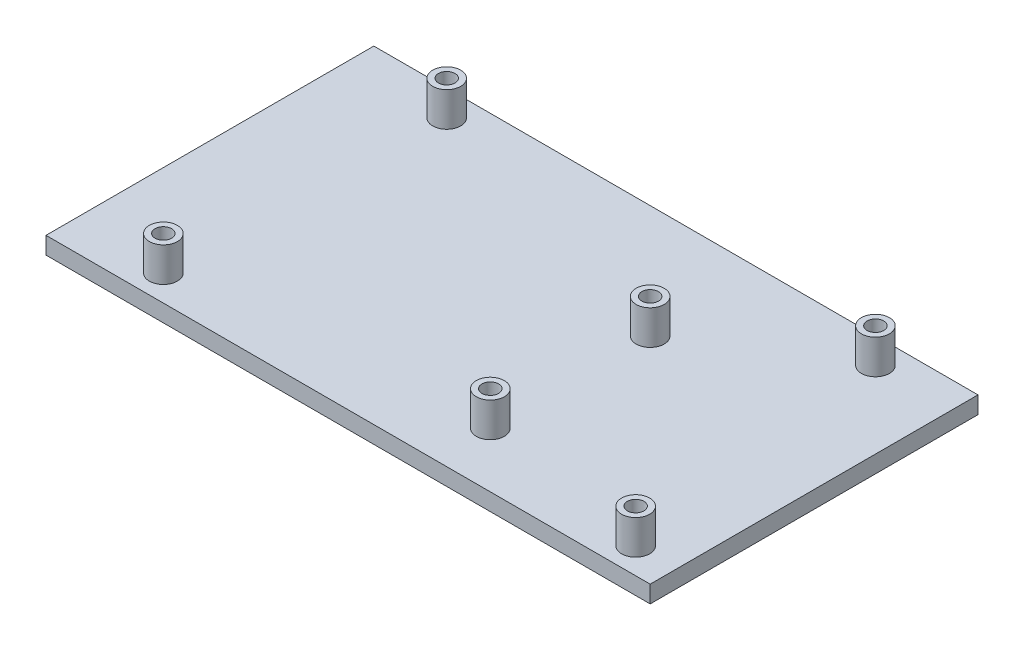
ISO-10303-21;
HEADER;
FILE_DESCRIPTION(('STEP AP214'),'2;1');
FILE_NAME('part.step','',(''),(''),'','','');
FILE_SCHEMA(('AUTOMOTIVE_DESIGN { 1 0 10303 214 1 1 1 1 }'));
ENDSEC;
DATA;
#1=APPLICATION_CONTEXT('core data for automotive mechanical design processes');
#2=APPLICATION_PROTOCOL_DEFINITION('international standard','automotive_design',2000,#1);
#3=PRODUCT_CONTEXT('',#1,'mechanical');
#4=PRODUCT('Part','Part','',(#3));
#5=PRODUCT_RELATED_PRODUCT_CATEGORY('part','',(#4));
#6=PRODUCT_DEFINITION_FORMATION('','',#4);
#7=PRODUCT_DEFINITION_CONTEXT('part definition',#1,'design');
#8=PRODUCT_DEFINITION('design','',#6,#7);
#9=PRODUCT_DEFINITION_SHAPE('','',#8);
#10=(LENGTH_UNIT() NAMED_UNIT(*) SI_UNIT(.MILLI.,.METRE.));
#11=(NAMED_UNIT(*) PLANE_ANGLE_UNIT() SI_UNIT($,.RADIAN.));
#12=(NAMED_UNIT(*) SI_UNIT($,.STERADIAN.) SOLID_ANGLE_UNIT());
#13=UNCERTAINTY_MEASURE_WITH_UNIT(LENGTH_MEASURE(1.E-05),#10,'distance_accuracy_value','');
#14=(GEOMETRIC_REPRESENTATION_CONTEXT(3) GLOBAL_UNCERTAINTY_ASSIGNED_CONTEXT((#13)) GLOBAL_UNIT_ASSIGNED_CONTEXT((#10,
#11,#12)) REPRESENTATION_CONTEXT('',''));
#15=CARTESIAN_POINT('',(0.,0.,0.));
#16=DIRECTION('',(0.,0.,1.));
#17=DIRECTION('',(1.,0.,0.));
#18=AXIS2_PLACEMENT_3D('',#15,#16,#17);
#19=CARTESIAN_POINT('',(-2.,-3.,0.));
#20=DIRECTION('',(1.,0.,0.));
#21=DIRECTION('',(0.,0.,-1.));
#22=AXIS2_PLACEMENT_3D('',#19,#20,#21);
#23=PLANE('',#22);
#24=DIRECTION('',(0.,0.,-1.));
#25=VECTOR('',#24,1.);
#26=CARTESIAN_POINT('',(-2.,0.,0.));
#27=LINE('',#26,#25);
#28=CARTESIAN_POINT('',(-2.,0.,2.));
#29=VERTEX_POINT('',#28);
#30=CARTESIAN_POINT('',(-2.,0.,-55.3));
#31=VERTEX_POINT('',#30);
#32=EDGE_CURVE('E120',#29,#31,#27,.T.);
#33=ORIENTED_EDGE('',*,*,#32,.T.);
#34=DIRECTION('',(0.,1.,0.));
#35=VECTOR('',#34,1.);
#36=CARTESIAN_POINT('',(-2.,-3.,-55.3));
#37=LINE('',#36,#35);
#38=CARTESIAN_POINT('',(-2.,-3.,-55.3));
#39=VERTEX_POINT('',#38);
#40=EDGE_CURVE('E132',#39,#31,#37,.T.);
#41=ORIENTED_EDGE('',*,*,#40,.F.);
#42=DIRECTION('',(0.,0.,-1.));
#43=VECTOR('',#42,1.);
#44=CARTESIAN_POINT('',(-2.,-3.,0.));
#45=LINE('',#44,#43);
#46=CARTESIAN_POINT('',(-2.,-3.,2.));
#47=VERTEX_POINT('',#46);
#48=EDGE_CURVE('E112',#47,#39,#45,.T.);
#49=ORIENTED_EDGE('',*,*,#48,.F.);
#50=DIRECTION('',(0.,1.,0.));
#51=VECTOR('',#50,1.);
#52=CARTESIAN_POINT('',(-2.,-3.,2.));
#53=LINE('',#52,#51);
#54=EDGE_CURVE('E93',#47,#29,#53,.T.);
#55=ORIENTED_EDGE('',*,*,#54,.T.);
#56=EDGE_LOOP('',(#33,#41,#49,#55));
#57=FACE_BOUND('',#56,.T.);
#58=ADVANCED_FACE('F47',(#57),#23,.F.);
#59=CARTESIAN_POINT('',(0.,-3.,-55.3));
#60=DIRECTION('',(0.,0.,1.));
#61=DIRECTION('',(1.,0.,0.));
#62=AXIS2_PLACEMENT_3D('',#59,#60,#61);
#63=PLANE('',#62);
#64=DIRECTION('',(1.,0.,0.));
#65=VECTOR('',#64,1.);
#66=CARTESIAN_POINT('',(0.,0.,-55.3));
#67=LINE('',#66,#65);
#68=CARTESIAN_POINT('',(103.6,0.,-55.3));
#69=VERTEX_POINT('',#68);
#70=EDGE_CURVE('E87',#31,#69,#67,.T.);
#71=ORIENTED_EDGE('',*,*,#70,.T.);
#72=DIRECTION('',(0.,1.,0.));
#73=VECTOR('',#72,1.);
#74=CARTESIAN_POINT('',(103.6,-3.,-55.3));
#75=LINE('',#74,#73);
#76=CARTESIAN_POINT('',(103.6,-3.,-55.3));
#77=VERTEX_POINT('',#76);
#78=EDGE_CURVE('E80',#77,#69,#75,.T.);
#79=ORIENTED_EDGE('',*,*,#78,.F.);
#80=DIRECTION('',(1.,0.,0.));
#81=VECTOR('',#80,1.);
#82=CARTESIAN_POINT('',(0.,-3.,-55.3));
#83=LINE('',#82,#81);
#84=EDGE_CURVE('E64',#39,#77,#83,.T.);
#85=ORIENTED_EDGE('',*,*,#84,.F.);
#86=ORIENTED_EDGE('',*,*,#40,.T.);
#87=EDGE_LOOP('',(#71,#79,#85,#86));
#88=FACE_BOUND('',#87,.T.);
#89=ADVANCED_FACE('F188',(#88),#63,.F.);
#90=CARTESIAN_POINT('',(103.6,-3.,0.));
#91=DIRECTION('',(1.,0.,0.));
#92=DIRECTION('',(0.,0.,-1.));
#93=AXIS2_PLACEMENT_3D('',#90,#91,#92);
#94=PLANE('',#93);
#95=DIRECTION('',(0.,0.,-1.));
#96=VECTOR('',#95,1.);
#97=CARTESIAN_POINT('',(103.6,0.,0.));
#98=LINE('',#97,#96);
#99=CARTESIAN_POINT('',(103.6,0.,2.));
#100=VERTEX_POINT('',#99);
#101=EDGE_CURVE('E100',#100,#69,#98,.T.);
#102=ORIENTED_EDGE('',*,*,#101,.F.);
#103=DIRECTION('',(0.,1.,0.));
#104=VECTOR('',#103,1.);
#105=CARTESIAN_POINT('',(103.6,-3.,2.));
#106=LINE('',#105,#104);
#107=CARTESIAN_POINT('',(103.6,-3.,2.));
#108=VERTEX_POINT('',#107);
#109=EDGE_CURVE('E96',#108,#100,#106,.T.);
#110=ORIENTED_EDGE('',*,*,#109,.F.);
#111=DIRECTION('',(0.,0.,-1.));
#112=VECTOR('',#111,1.);
#113=CARTESIAN_POINT('',(103.6,-3.,0.));
#114=LINE('',#113,#112);
#115=EDGE_CURVE('E99',#108,#77,#114,.T.);
#116=ORIENTED_EDGE('',*,*,#115,.T.);
#117=ORIENTED_EDGE('',*,*,#78,.T.);
#118=EDGE_LOOP('',(#102,#110,#116,#117));
#119=FACE_BOUND('',#118,.T.);
#120=ADVANCED_FACE('F98',(#119),#94,.T.);
#121=CARTESIAN_POINT('',(0.,-3.,2.));
#122=DIRECTION('',(0.,0.,1.));
#123=DIRECTION('',(1.,0.,0.));
#124=AXIS2_PLACEMENT_3D('',#121,#122,#123);
#125=PLANE('',#124);
#126=DIRECTION('',(1.,0.,0.));
#127=VECTOR('',#126,1.);
#128=CARTESIAN_POINT('',(0.,0.,2.));
#129=LINE('',#128,#127);
#130=EDGE_CURVE('E124',#29,#100,#129,.T.);
#131=ORIENTED_EDGE('',*,*,#130,.F.);
#132=ORIENTED_EDGE('',*,*,#54,.F.);
#133=DIRECTION('',(1.,0.,0.));
#134=VECTOR('',#133,1.);
#135=CARTESIAN_POINT('',(0.,-3.,2.));
#136=LINE('',#135,#134);
#137=EDGE_CURVE('E107',#47,#108,#136,.T.);
#138=ORIENTED_EDGE('',*,*,#137,.T.);
#139=ORIENTED_EDGE('',*,*,#109,.T.);
#140=EDGE_LOOP('',(#131,#132,#138,#139));
#141=FACE_BOUND('',#140,.T.);
#142=ADVANCED_FACE('F110',(#141),#125,.T.);
#143=CARTESIAN_POINT('',(0.,-3.,0.));
#144=DIRECTION('',(0.,1.,0.));
#145=DIRECTION('',(0.,0.,1.));
#146=AXIS2_PLACEMENT_3D('',#143,#144,#145);
#147=PLANE('',#146);
#148=ORIENTED_EDGE('',*,*,#48,.T.);
#149=ORIENTED_EDGE('',*,*,#84,.T.);
#150=ORIENTED_EDGE('',*,*,#115,.F.);
#151=ORIENTED_EDGE('',*,*,#137,.F.);
#152=EDGE_LOOP('',(#148,#149,#150,#151));
#153=FACE_BOUND('',#152,.T.);
#154=ADVANCED_FACE('F106',(#153),#147,.F.);
#155=CARTESIAN_POINT('',(0.,0.,0.));
#156=DIRECTION('',(0.,1.,0.));
#157=DIRECTION('',(0.,0.,1.));
#158=AXIS2_PLACEMENT_3D('',#155,#156,#157);
#159=PLANE('',#158);
#160=CARTESIAN_POINT('',(13.97,0.,-2.54));
#161=DIRECTION('',(0.,1.,0.));
#162=DIRECTION('',(0.,0.,1.));
#163=AXIS2_PLACEMENT_3D('',#160,#161,#162);
#164=CIRCLE('',#163,2.45);
#165=CARTESIAN_POINT('',(13.97,0.,-0.0899999999999994));
#166=VERTEX_POINT('',#165);
#167=EDGE_CURVE('E333',#166,#166,#164,.T.);
#168=ORIENTED_EDGE('',*,*,#167,.F.);
#169=EDGE_LOOP('',(#168));
#170=FACE_BOUND('',#169,.T.);
#171=CARTESIAN_POINT('',(15.24,0.,-50.8));
#172=DIRECTION('',(0.,1.,0.));
#173=DIRECTION('',(0.,0.,1.));
#174=AXIS2_PLACEMENT_3D('',#171,#172,#173);
#175=CIRCLE('',#174,2.45);
#176=CARTESIAN_POINT('',(15.24,0.,-48.35));
#177=VERTEX_POINT('',#176);
#178=EDGE_CURVE('E314',#177,#177,#175,.T.);
#179=ORIENTED_EDGE('',*,*,#178,.F.);
#180=EDGE_LOOP('',(#179));
#181=FACE_BOUND('',#180,.T.);
#182=CARTESIAN_POINT('',(90.17,0.,-50.8));
#183=DIRECTION('',(0.,1.,0.));
#184=DIRECTION('',(0.,0.,1.));
#185=AXIS2_PLACEMENT_3D('',#182,#183,#184);
#186=CIRCLE('',#185,2.44999999999999);
#187=CARTESIAN_POINT('',(90.17,0.,-48.35));
#188=VERTEX_POINT('',#187);
#189=EDGE_CURVE('E302',#188,#188,#186,.T.);
#190=ORIENTED_EDGE('',*,*,#189,.F.);
#191=EDGE_LOOP('',(#190));
#192=FACE_BOUND('',#191,.T.);
#193=CARTESIAN_POINT('',(66.04,0.,-35.56));
#194=DIRECTION('',(0.,1.,0.));
#195=DIRECTION('',(0.,0.,1.));
#196=AXIS2_PLACEMENT_3D('',#193,#194,#195);
#197=CIRCLE('',#196,2.44999999999999);
#198=CARTESIAN_POINT('',(66.04,0.,-33.11));
#199=VERTEX_POINT('',#198);
#200=EDGE_CURVE('E292',#199,#199,#197,.T.);
#201=ORIENTED_EDGE('',*,*,#200,.F.);
#202=EDGE_LOOP('',(#201));
#203=FACE_BOUND('',#202,.T.);
#204=CARTESIAN_POINT('',(96.52,0.,-2.54));
#205=DIRECTION('',(0.,1.,0.));
#206=DIRECTION('',(0.,0.,1.));
#207=AXIS2_PLACEMENT_3D('',#204,#205,#206);
#208=CIRCLE('',#207,2.45000000000001);
#209=CARTESIAN_POINT('',(96.52,0.,-0.0899999999999924));
#210=VERTEX_POINT('',#209);
#211=EDGE_CURVE('E275',#210,#210,#208,.T.);
#212=ORIENTED_EDGE('',*,*,#211,.F.);
#213=EDGE_LOOP('',(#212));
#214=FACE_BOUND('',#213,.T.);
#215=CARTESIAN_POINT('',(66.04,0.,-7.62));
#216=DIRECTION('',(0.,1.,0.));
#217=DIRECTION('',(0.,0.,1.));
#218=AXIS2_PLACEMENT_3D('',#215,#216,#217);
#219=CIRCLE('',#218,2.44999999999999);
#220=CARTESIAN_POINT('',(66.04,0.,-5.17000000000001));
#221=VERTEX_POINT('',#220);
#222=EDGE_CURVE('E271',#221,#221,#219,.T.);
#223=ORIENTED_EDGE('',*,*,#222,.F.);
#224=EDGE_LOOP('',(#223));
#225=FACE_BOUND('',#224,.T.);
#226=ORIENTED_EDGE('',*,*,#32,.F.);
#227=ORIENTED_EDGE('',*,*,#130,.T.);
#228=ORIENTED_EDGE('',*,*,#101,.T.);
#229=ORIENTED_EDGE('',*,*,#70,.F.);
#230=EDGE_LOOP('',(#226,#227,#228,#229));
#231=FACE_BOUND('',#230,.T.);
#232=ADVANCED_FACE('F177',(#170,#181,#192,#203,#214,#225,#231),#159,.T.);
#233=CARTESIAN_POINT('',(66.04,6.,-7.62));
#234=DIRECTION('',(0.,-1.,0.));
#235=DIRECTION('',(0.,0.,-1.));
#236=AXIS2_PLACEMENT_3D('',#233,#234,#235);
#237=CYLINDRICAL_SURFACE('',#236,1.45);
#238=CARTESIAN_POINT('',(66.04,6.,-7.62));
#239=DIRECTION('',(0.,1.,0.));
#240=DIRECTION('',(0.,0.,1.));
#241=AXIS2_PLACEMENT_3D('',#238,#239,#240);
#242=CIRCLE('',#241,1.45);
#243=CARTESIAN_POINT('',(66.04,6.,-6.17));
#244=VERTEX_POINT('',#243);
#245=EDGE_CURVE('E274',#244,#244,#242,.T.);
#246=ORIENTED_EDGE('',*,*,#245,.T.);
#247=EDGE_LOOP('',(#246));
#248=FACE_BOUND('',#247,.T.);
#249=CARTESIAN_POINT('',(66.04,0.,-7.62));
#250=DIRECTION('',(0.,1.,0.));
#251=DIRECTION('',(0.,0.,1.));
#252=AXIS2_PLACEMENT_3D('',#249,#250,#251);
#253=CIRCLE('',#252,1.45);
#254=CARTESIAN_POINT('',(66.04,0.,-6.17));
#255=VERTEX_POINT('',#254);
#256=EDGE_CURVE('E135',#255,#255,#253,.F.);
#257=ORIENTED_EDGE('',*,*,#256,.T.);
#258=EDGE_LOOP('',(#257));
#259=FACE_BOUND('',#258,.T.);
#260=ADVANCED_FACE('F195',(#248,#259),#237,.F.);
#261=CARTESIAN_POINT('',(66.04,6.,-7.62));
#262=DIRECTION('',(0.,-1.,0.));
#263=DIRECTION('',(0.,0.,-1.));
#264=AXIS2_PLACEMENT_3D('',#261,#262,#263);
#265=CYLINDRICAL_SURFACE('',#264,2.44999999999999);
#266=CARTESIAN_POINT('',(66.04,6.,-7.62));
#267=DIRECTION('',(0.,1.,0.));
#268=DIRECTION('',(0.,0.,1.));
#269=AXIS2_PLACEMENT_3D('',#266,#267,#268);
#270=CIRCLE('',#269,2.44999999999999);
#271=CARTESIAN_POINT('',(66.04,6.,-5.17000000000001));
#272=VERTEX_POINT('',#271);
#273=EDGE_CURVE('E125',#272,#272,#270,.T.);
#274=ORIENTED_EDGE('',*,*,#273,.F.);
#275=EDGE_LOOP('',(#274));
#276=FACE_BOUND('',#275,.T.);
#277=ORIENTED_EDGE('',*,*,#222,.T.);
#278=EDGE_LOOP('',(#277));
#279=FACE_BOUND('',#278,.T.);
#280=ADVANCED_FACE('F202',(#276,#279),#265,.T.);
#281=CARTESIAN_POINT('',(0.,6.,0.));
#282=DIRECTION('',(0.,1.,0.));
#283=DIRECTION('',(0.,0.,1.));
#284=AXIS2_PLACEMENT_3D('',#281,#282,#283);
#285=PLANE('',#284);
#286=ORIENTED_EDGE('',*,*,#245,.F.);
#287=EDGE_LOOP('',(#286));
#288=FACE_BOUND('',#287,.T.);
#289=ORIENTED_EDGE('',*,*,#273,.T.);
#290=EDGE_LOOP('',(#289));
#291=FACE_BOUND('',#290,.T.);
#292=ADVANCED_FACE('F209',(#288,#291),#285,.T.);
#293=ORIENTED_EDGE('',*,*,#256,.F.);
#294=EDGE_LOOP('',(#293));
#295=FACE_BOUND('',#294,.T.);
#296=ADVANCED_FACE('F197',(#295),#159,.T.);
#297=CARTESIAN_POINT('',(96.52,6.,-2.54));
#298=DIRECTION('',(0.,-1.,0.));
#299=DIRECTION('',(0.,0.,-1.));
#300=AXIS2_PLACEMENT_3D('',#297,#298,#299);
#301=CYLINDRICAL_SURFACE('',#300,1.45);
#302=CARTESIAN_POINT('',(96.52,6.,-2.54));
#303=DIRECTION('',(0.,1.,0.));
#304=DIRECTION('',(0.,0.,1.));
#305=AXIS2_PLACEMENT_3D('',#302,#303,#304);
#306=CIRCLE('',#305,1.45);
#307=CARTESIAN_POINT('',(96.52,6.,-1.09));
#308=VERTEX_POINT('',#307);
#309=EDGE_CURVE('E281',#308,#308,#306,.T.);
#310=ORIENTED_EDGE('',*,*,#309,.T.);
#311=EDGE_LOOP('',(#310));
#312=FACE_BOUND('',#311,.T.);
#313=CARTESIAN_POINT('',(96.52,0.,-2.54));
#314=DIRECTION('',(0.,1.,0.));
#315=DIRECTION('',(0.,0.,1.));
#316=AXIS2_PLACEMENT_3D('',#313,#314,#315);
#317=CIRCLE('',#316,1.45);
#318=CARTESIAN_POINT('',(96.52,0.,-1.09));
#319=VERTEX_POINT('',#318);
#320=EDGE_CURVE('E143',#319,#319,#317,.F.);
#321=ORIENTED_EDGE('',*,*,#320,.T.);
#322=EDGE_LOOP('',(#321));
#323=FACE_BOUND('',#322,.T.);
#324=ADVANCED_FACE('F208',(#312,#323),#301,.F.);
#325=CARTESIAN_POINT('',(96.52,6.,-2.54));
#326=DIRECTION('',(0.,-1.,0.));
#327=DIRECTION('',(0.,0.,-1.));
#328=AXIS2_PLACEMENT_3D('',#325,#326,#327);
#329=CYLINDRICAL_SURFACE('',#328,2.45000000000001);
#330=CARTESIAN_POINT('',(96.52,6.,-2.54));
#331=DIRECTION('',(0.,1.,0.));
#332=DIRECTION('',(0.,0.,1.));
#333=AXIS2_PLACEMENT_3D('',#330,#331,#332);
#334=CIRCLE('',#333,2.45000000000001);
#335=CARTESIAN_POINT('',(96.52,6.,-0.0899999999999924));
#336=VERTEX_POINT('',#335);
#337=EDGE_CURVE('E289',#336,#336,#334,.T.);
#338=ORIENTED_EDGE('',*,*,#337,.F.);
#339=EDGE_LOOP('',(#338));
#340=FACE_BOUND('',#339,.T.);
#341=ORIENTED_EDGE('',*,*,#211,.T.);
#342=EDGE_LOOP('',(#341));
#343=FACE_BOUND('',#342,.T.);
#344=ADVANCED_FACE('F216',(#340,#343),#329,.T.);
#345=CARTESIAN_POINT('',(0.,6.,0.));
#346=DIRECTION('',(0.,1.,0.));
#347=DIRECTION('',(0.,0.,1.));
#348=AXIS2_PLACEMENT_3D('',#345,#346,#347);
#349=PLANE('',#348);
#350=ORIENTED_EDGE('',*,*,#309,.F.);
#351=EDGE_LOOP('',(#350));
#352=FACE_BOUND('',#351,.T.);
#353=ORIENTED_EDGE('',*,*,#337,.T.);
#354=EDGE_LOOP('',(#353));
#355=FACE_BOUND('',#354,.T.);
#356=ADVANCED_FACE('F224',(#352,#355),#349,.T.);
#357=ORIENTED_EDGE('',*,*,#320,.F.);
#358=EDGE_LOOP('',(#357));
#359=FACE_BOUND('',#358,.T.);
#360=ADVANCED_FACE('F211',(#359),#159,.T.);
#361=CARTESIAN_POINT('',(66.04,6.,-35.56));
#362=DIRECTION('',(0.,-1.,0.));
#363=DIRECTION('',(0.,0.,-1.));
#364=AXIS2_PLACEMENT_3D('',#361,#362,#363);
#365=CYLINDRICAL_SURFACE('',#364,1.45);
#366=CARTESIAN_POINT('',(66.04,6.,-35.56));
#367=DIRECTION('',(0.,1.,0.));
#368=DIRECTION('',(0.,0.,1.));
#369=AXIS2_PLACEMENT_3D('',#366,#367,#368);
#370=CIRCLE('',#369,1.45);
#371=CARTESIAN_POINT('',(66.04,6.,-34.11));
#372=VERTEX_POINT('',#371);
#373=EDGE_CURVE('E294',#372,#372,#370,.T.);
#374=ORIENTED_EDGE('',*,*,#373,.T.);
#375=EDGE_LOOP('',(#374));
#376=FACE_BOUND('',#375,.T.);
#377=CARTESIAN_POINT('',(66.04,0.,-35.56));
#378=DIRECTION('',(0.,1.,0.));
#379=DIRECTION('',(0.,0.,1.));
#380=AXIS2_PLACEMENT_3D('',#377,#378,#379);
#381=CIRCLE('',#380,1.45);
#382=CARTESIAN_POINT('',(66.04,0.,-34.11));
#383=VERTEX_POINT('',#382);
#384=EDGE_CURVE('E147',#383,#383,#381,.F.);
#385=ORIENTED_EDGE('',*,*,#384,.T.);
#386=EDGE_LOOP('',(#385));
#387=FACE_BOUND('',#386,.T.);
#388=ADVANCED_FACE('F223',(#376,#387),#365,.F.);
#389=CARTESIAN_POINT('',(66.04,6.,-35.56));
#390=DIRECTION('',(0.,-1.,0.));
#391=DIRECTION('',(0.,0.,-1.));
#392=AXIS2_PLACEMENT_3D('',#389,#390,#391);
#393=CYLINDRICAL_SURFACE('',#392,2.44999999999999);
#394=CARTESIAN_POINT('',(66.04,6.,-35.56));
#395=DIRECTION('',(0.,1.,0.));
#396=DIRECTION('',(0.,0.,1.));
#397=AXIS2_PLACEMENT_3D('',#394,#395,#396);
#398=CIRCLE('',#397,2.44999999999999);
#399=CARTESIAN_POINT('',(66.04,6.,-33.11));
#400=VERTEX_POINT('',#399);
#401=EDGE_CURVE('E298',#400,#400,#398,.T.);
#402=ORIENTED_EDGE('',*,*,#401,.F.);
#403=EDGE_LOOP('',(#402));
#404=FACE_BOUND('',#403,.T.);
#405=ORIENTED_EDGE('',*,*,#200,.T.);
#406=EDGE_LOOP('',(#405));
#407=FACE_BOUND('',#406,.T.);
#408=ADVANCED_FACE('F230',(#404,#407),#393,.T.);
#409=CARTESIAN_POINT('',(0.,6.,0.));
#410=DIRECTION('',(0.,1.,0.));
#411=DIRECTION('',(0.,0.,1.));
#412=AXIS2_PLACEMENT_3D('',#409,#410,#411);
#413=PLANE('',#412);
#414=ORIENTED_EDGE('',*,*,#373,.F.);
#415=EDGE_LOOP('',(#414));
#416=FACE_BOUND('',#415,.T.);
#417=ORIENTED_EDGE('',*,*,#401,.T.);
#418=EDGE_LOOP('',(#417));
#419=FACE_BOUND('',#418,.T.);
#420=ADVANCED_FACE('F238',(#416,#419),#413,.T.);
#421=ORIENTED_EDGE('',*,*,#384,.F.);
#422=EDGE_LOOP('',(#421));
#423=FACE_BOUND('',#422,.T.);
#424=ADVANCED_FACE('F183',(#423),#159,.T.);
#425=CARTESIAN_POINT('',(90.17,6.,-50.8));
#426=DIRECTION('',(0.,-1.,0.));
#427=DIRECTION('',(0.,0.,-1.));
#428=AXIS2_PLACEMENT_3D('',#425,#426,#427);
#429=CYLINDRICAL_SURFACE('',#428,1.45);
#430=CARTESIAN_POINT('',(90.17,6.,-50.8));
#431=DIRECTION('',(0.,1.,0.));
#432=DIRECTION('',(0.,0.,1.));
#433=AXIS2_PLACEMENT_3D('',#430,#431,#432);
#434=CIRCLE('',#433,1.45);
#435=CARTESIAN_POINT('',(90.17,6.,-49.35));
#436=VERTEX_POINT('',#435);
#437=EDGE_CURVE('E306',#436,#436,#434,.T.);
#438=ORIENTED_EDGE('',*,*,#437,.T.);
#439=EDGE_LOOP('',(#438));
#440=FACE_BOUND('',#439,.T.);
#441=CARTESIAN_POINT('',(90.17,0.,-50.8));
#442=DIRECTION('',(0.,1.,0.));
#443=DIRECTION('',(0.,0.,1.));
#444=AXIS2_PLACEMENT_3D('',#441,#442,#443);
#445=CIRCLE('',#444,1.45);
#446=CARTESIAN_POINT('',(90.17,0.,-49.35));
#447=VERTEX_POINT('',#446);
#448=EDGE_CURVE('E151',#447,#447,#445,.F.);
#449=ORIENTED_EDGE('',*,*,#448,.T.);
#450=EDGE_LOOP('',(#449));
#451=FACE_BOUND('',#450,.T.);
#452=ADVANCED_FACE('F237',(#440,#451),#429,.F.);
#453=CARTESIAN_POINT('',(90.17,6.,-50.8));
#454=DIRECTION('',(0.,-1.,0.));
#455=DIRECTION('',(0.,0.,-1.));
#456=AXIS2_PLACEMENT_3D('',#453,#454,#455);
#457=CYLINDRICAL_SURFACE('',#456,2.44999999999999);
#458=CARTESIAN_POINT('',(90.17,6.,-50.8));
#459=DIRECTION('',(0.,1.,0.));
#460=DIRECTION('',(0.,0.,1.));
#461=AXIS2_PLACEMENT_3D('',#458,#459,#460);
#462=CIRCLE('',#461,2.44999999999999);
#463=CARTESIAN_POINT('',(90.17,6.,-48.35));
#464=VERTEX_POINT('',#463);
#465=EDGE_CURVE('E310',#464,#464,#462,.T.);
#466=ORIENTED_EDGE('',*,*,#465,.F.);
#467=EDGE_LOOP('',(#466));
#468=FACE_BOUND('',#467,.T.);
#469=ORIENTED_EDGE('',*,*,#189,.T.);
#470=EDGE_LOOP('',(#469));
#471=FACE_BOUND('',#470,.T.);
#472=ADVANCED_FACE('F244',(#468,#471),#457,.T.);
#473=CARTESIAN_POINT('',(0.,6.,0.));
#474=DIRECTION('',(0.,1.,0.));
#475=DIRECTION('',(0.,0.,1.));
#476=AXIS2_PLACEMENT_3D('',#473,#474,#475);
#477=PLANE('',#476);
#478=ORIENTED_EDGE('',*,*,#437,.F.);
#479=EDGE_LOOP('',(#478));
#480=FACE_BOUND('',#479,.T.);
#481=ORIENTED_EDGE('',*,*,#465,.T.);
#482=EDGE_LOOP('',(#481));
#483=FACE_BOUND('',#482,.T.);
#484=ADVANCED_FACE('F181',(#480,#483),#477,.T.);
#485=ORIENTED_EDGE('',*,*,#448,.F.);
#486=EDGE_LOOP('',(#485));
#487=FACE_BOUND('',#486,.T.);
#488=ADVANCED_FACE('F165',(#487),#159,.T.);
#489=CARTESIAN_POINT('',(15.24,6.,-50.8));
#490=DIRECTION('',(0.,-1.,0.));
#491=DIRECTION('',(0.,0.,-1.));
#492=AXIS2_PLACEMENT_3D('',#489,#490,#491);
#493=CYLINDRICAL_SURFACE('',#492,1.45);
#494=CARTESIAN_POINT('',(15.24,6.,-50.8));
#495=DIRECTION('',(0.,1.,0.));
#496=DIRECTION('',(0.,0.,1.));
#497=AXIS2_PLACEMENT_3D('',#494,#495,#496);
#498=CIRCLE('',#497,1.45);
#499=CARTESIAN_POINT('',(15.24,6.,-49.35));
#500=VERTEX_POINT('',#499);
#501=EDGE_CURVE('E318',#500,#500,#498,.T.);
#502=ORIENTED_EDGE('',*,*,#501,.T.);
#503=EDGE_LOOP('',(#502));
#504=FACE_BOUND('',#503,.T.);
#505=CARTESIAN_POINT('',(15.24,0.,-50.8));
#506=DIRECTION('',(0.,1.,0.));
#507=DIRECTION('',(0.,0.,1.));
#508=AXIS2_PLACEMENT_3D('',#505,#506,#507);
#509=CIRCLE('',#508,1.45);
#510=CARTESIAN_POINT('',(15.24,0.,-49.35));
#511=VERTEX_POINT('',#510);
#512=EDGE_CURVE('E56',#511,#511,#509,.F.);
#513=ORIENTED_EDGE('',*,*,#512,.T.);
#514=EDGE_LOOP('',(#513));
#515=FACE_BOUND('',#514,.T.);
#516=ADVANCED_FACE('F158',(#504,#515),#493,.F.);
#517=CARTESIAN_POINT('',(15.24,6.,-50.8));
#518=DIRECTION('',(0.,-1.,0.));
#519=DIRECTION('',(0.,0.,-1.));
#520=AXIS2_PLACEMENT_3D('',#517,#518,#519);
#521=CYLINDRICAL_SURFACE('',#520,2.45);
#522=CARTESIAN_POINT('',(15.24,6.,-50.8));
#523=DIRECTION('',(0.,1.,0.));
#524=DIRECTION('',(0.,0.,1.));
#525=AXIS2_PLACEMENT_3D('',#522,#523,#524);
#526=CIRCLE('',#525,2.45);
#527=CARTESIAN_POINT('',(15.24,6.,-48.35));
#528=VERTEX_POINT('',#527);
#529=EDGE_CURVE('E322',#528,#528,#526,.T.);
#530=ORIENTED_EDGE('',*,*,#529,.F.);
#531=EDGE_LOOP('',(#530));
#532=FACE_BOUND('',#531,.T.);
#533=ORIENTED_EDGE('',*,*,#178,.T.);
#534=EDGE_LOOP('',(#533));
#535=FACE_BOUND('',#534,.T.);
#536=ADVANCED_FACE('F174',(#532,#535),#521,.T.);
#537=CARTESIAN_POINT('',(0.,6.,0.));
#538=DIRECTION('',(0.,1.,0.));
#539=DIRECTION('',(0.,0.,1.));
#540=AXIS2_PLACEMENT_3D('',#537,#538,#539);
#541=PLANE('',#540);
#542=ORIENTED_EDGE('',*,*,#501,.F.);
#543=EDGE_LOOP('',(#542));
#544=FACE_BOUND('',#543,.T.);
#545=ORIENTED_EDGE('',*,*,#529,.T.);
#546=EDGE_LOOP('',(#545));
#547=FACE_BOUND('',#546,.T.);
#548=ADVANCED_FACE('F163',(#544,#547),#541,.T.);
#549=ORIENTED_EDGE('',*,*,#512,.F.);
#550=EDGE_LOOP('',(#549));
#551=FACE_BOUND('',#550,.T.);
#552=ADVANCED_FACE('F160',(#551),#159,.T.);
#553=CARTESIAN_POINT('',(13.97,6.,-2.54));
#554=DIRECTION('',(0.,1.,0.));
#555=DIRECTION('',(0.,0.,1.));
#556=AXIS2_PLACEMENT_3D('',#553,#554,#555);
#557=PLANE('',#556);
#558=CARTESIAN_POINT('',(13.97,6.,-2.54));
#559=DIRECTION('',(0.,1.,0.));
#560=DIRECTION('',(0.,0.,1.));
#561=AXIS2_PLACEMENT_3D('',#558,#559,#560);
#562=CIRCLE('',#561,2.45);
#563=CARTESIAN_POINT('',(13.97,6.,-0.0899999999999994));
#564=VERTEX_POINT('',#563);
#565=EDGE_CURVE('E334',#564,#564,#562,.T.);
#566=ORIENTED_EDGE('',*,*,#565,.T.);
#567=EDGE_LOOP('',(#566));
#568=FACE_BOUND('',#567,.T.);
#569=CARTESIAN_POINT('',(13.97,6.,-2.54));
#570=DIRECTION('',(0.,1.,0.));
#571=DIRECTION('',(0.,0.,1.));
#572=AXIS2_PLACEMENT_3D('',#569,#570,#571);
#573=CIRCLE('',#572,1.45);
#574=CARTESIAN_POINT('',(13.97,6.,-1.09));
#575=VERTEX_POINT('',#574);
#576=EDGE_CURVE('E326',#575,#575,#573,.T.);
#577=ORIENTED_EDGE('',*,*,#576,.F.);
#578=EDGE_LOOP('',(#577));
#579=FACE_BOUND('',#578,.T.);
#580=ADVANCED_FACE('F162',(#568,#579),#557,.T.);
#581=CARTESIAN_POINT('',(13.97,6.,-2.54));
#582=DIRECTION('',(0.,-1.,0.));
#583=DIRECTION('',(0.,0.,-1.));
#584=AXIS2_PLACEMENT_3D('',#581,#582,#583);
#585=CYLINDRICAL_SURFACE('',#584,2.45);
#586=ORIENTED_EDGE('',*,*,#565,.F.);
#587=EDGE_LOOP('',(#586));
#588=FACE_BOUND('',#587,.T.);
#589=ORIENTED_EDGE('',*,*,#167,.T.);
#590=EDGE_LOOP('',(#589));
#591=FACE_BOUND('',#590,.T.);
#592=ADVANCED_FACE('F171',(#588,#591),#585,.T.);
#593=CARTESIAN_POINT('',(13.97,6.,-2.54));
#594=DIRECTION('',(0.,-1.,0.));
#595=DIRECTION('',(0.,0.,-1.));
#596=AXIS2_PLACEMENT_3D('',#593,#594,#595);
#597=CYLINDRICAL_SURFACE('',#596,1.45);
#598=ORIENTED_EDGE('',*,*,#576,.T.);
#599=EDGE_LOOP('',(#598));
#600=FACE_BOUND('',#599,.T.);
#601=CARTESIAN_POINT('',(13.97,0.,-2.54));
#602=DIRECTION('',(0.,1.,0.));
#603=DIRECTION('',(0.,0.,1.));
#604=AXIS2_PLACEMENT_3D('',#601,#602,#603);
#605=CIRCLE('',#604,1.45);
#606=CARTESIAN_POINT('',(13.97,0.,-1.09));
#607=VERTEX_POINT('',#606);
#608=EDGE_CURVE('E12',#607,#607,#605,.F.);
#609=ORIENTED_EDGE('',*,*,#608,.T.);
#610=EDGE_LOOP('',(#609));
#611=FACE_BOUND('',#610,.T.);
#612=ADVANCED_FACE('F185',(#600,#611),#597,.F.);
#613=ORIENTED_EDGE('',*,*,#608,.F.);
#614=EDGE_LOOP('',(#613));
#615=FACE_BOUND('',#614,.T.);
#616=ADVANCED_FACE('F166',(#615),#159,.T.);
#617=CLOSED_SHELL('',(#58,#89,#120,#142,#154,#232,#260,#280,#292,#296,#324,#344,#356,#360,#388,
#408,#420,#424,#452,#472,#484,#488,#516,#536,#548,#552,#580,#592,#612,#616));
#618=MANIFOLD_SOLID_BREP('B2',#617);
#619=ADVANCED_BREP_SHAPE_REPRESENTATION('',(#18,#618),#14);
#620=SHAPE_DEFINITION_REPRESENTATION(#9,#619);
ENDSEC;
END-ISO-10303-21;
